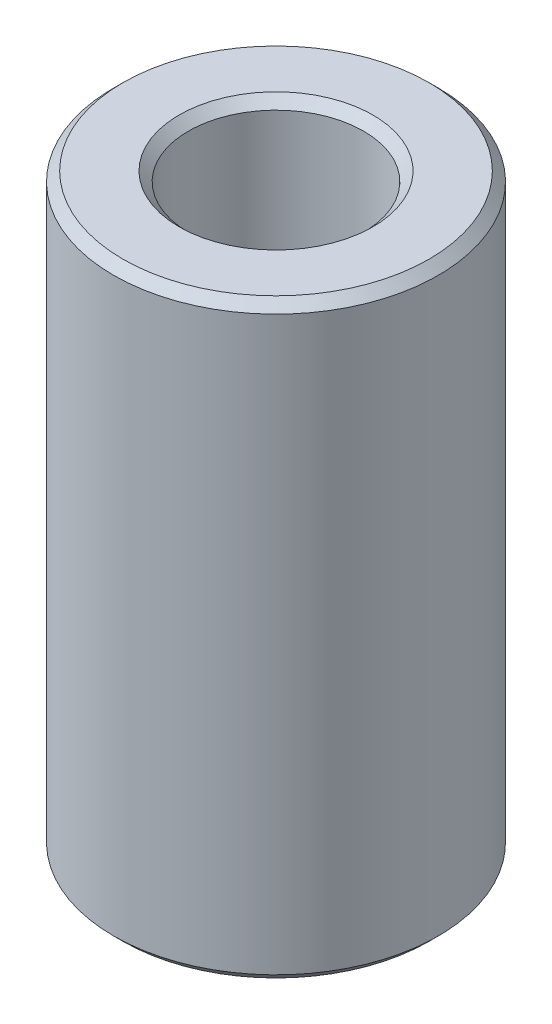
ISO-10303-21;
HEADER;
FILE_DESCRIPTION(('STEP AP214'),'2;1');
FILE_NAME('part.step','',(''),(''),'','','');
FILE_SCHEMA(('AUTOMOTIVE_DESIGN { 1 0 10303 214 1 1 1 1 }'));
ENDSEC;
DATA;
#1=APPLICATION_CONTEXT('core data for automotive mechanical design processes');
#2=APPLICATION_PROTOCOL_DEFINITION('international standard','automotive_design',2000,#1);
#3=PRODUCT_CONTEXT('',#1,'mechanical');
#4=PRODUCT('Part','Part','',(#3));
#5=PRODUCT_RELATED_PRODUCT_CATEGORY('part','',(#4));
#6=PRODUCT_DEFINITION_FORMATION('','',#4);
#7=PRODUCT_DEFINITION_CONTEXT('part definition',#1,'design');
#8=PRODUCT_DEFINITION('design','',#6,#7);
#9=PRODUCT_DEFINITION_SHAPE('','',#8);
#10=(LENGTH_UNIT() NAMED_UNIT(*) SI_UNIT(.MILLI.,.METRE.));
#11=(NAMED_UNIT(*) PLANE_ANGLE_UNIT() SI_UNIT($,.RADIAN.));
#12=(NAMED_UNIT(*) SI_UNIT($,.STERADIAN.) SOLID_ANGLE_UNIT());
#13=UNCERTAINTY_MEASURE_WITH_UNIT(LENGTH_MEASURE(1.E-05),#10,'distance_accuracy_value','');
#14=(GEOMETRIC_REPRESENTATION_CONTEXT(3) GLOBAL_UNCERTAINTY_ASSIGNED_CONTEXT((#13)) GLOBAL_UNIT_ASSIGNED_CONTEXT((#10,
#11,#12)) REPRESENTATION_CONTEXT('',''));
#15=CARTESIAN_POINT('',(0.,0.,0.));
#16=DIRECTION('',(0.,0.,1.));
#17=DIRECTION('',(1.,0.,0.));
#18=AXIS2_PLACEMENT_3D('',#15,#16,#17);
#19=CARTESIAN_POINT('',(0.,54.6031220626706,0.));
#20=DIRECTION('',(0.,-1.,0.));
#21=DIRECTION('',(0.,0.,-1.));
#22=AXIS2_PLACEMENT_3D('',#19,#20,#21);
#23=CYLINDRICAL_SURFACE('',#22,15.);
#24=CARTESIAN_POINT('',(0.,0.860244968208142,0.));
#25=DIRECTION('',(0.,1.,0.));
#26=DIRECTION('',(0.,0.,1.));
#27=AXIS2_PLACEMENT_3D('',#24,#25,#26);
#28=CIRCLE('',#27,15.);
#29=CARTESIAN_POINT('',(0.,0.860244968208142,-15.));
#30=VERTEX_POINT('',#29);
#31=EDGE_CURVE('E10',#30,#30,#28,.T.);
#32=CARTESIAN_POINT('',(0.,53.7428770944626,0.));
#33=DIRECTION('',(0.,1.,0.));
#34=DIRECTION('',(0.,0.,1.));
#35=AXIS2_PLACEMENT_3D('',#32,#33,#34);
#36=CIRCLE('',#35,15.);
#37=CARTESIAN_POINT('',(0.,53.7428770944626,-15.));
#38=VERTEX_POINT('',#37);
#39=EDGE_CURVE('E50',#38,#38,#36,.F.);
#40=CARTESIAN_POINT('',(0.,0.860244968208142,-15.));
#41=CARTESIAN_POINT('',(0.,1.41110571952329,-15.));
#42=CARTESIAN_POINT('',(0.,1.96196647083844,-15.));
#43=CARTESIAN_POINT('',(0.,3.06368797346874,-15.));
#44=CARTESIAN_POINT('',(0.,3.61454872478389,-15.));
#45=CARTESIAN_POINT('',(0.,4.71627022741419,-15.));
#46=CARTESIAN_POINT('',(0.,5.26713097872934,-15.));
#47=CARTESIAN_POINT('',(0.,6.36885248135964,-15.));
#48=CARTESIAN_POINT('',(0.,6.91971323267479,-15.));
#49=CARTESIAN_POINT('',(0.,8.0214347353051,-15.));
#50=CARTESIAN_POINT('',(0.,8.57229548662024,-15.));
#51=CARTESIAN_POINT('',(0.,9.67401698925054,-15.));
#52=CARTESIAN_POINT('',(0.,10.2248777405657,-15.));
#53=CARTESIAN_POINT('',(0.,11.326599243196,-15.));
#54=CARTESIAN_POINT('',(0.,11.8774599945111,-15.));
#55=CARTESIAN_POINT('',(0.,12.9791814971414,-15.));
#56=CARTESIAN_POINT('',(0.,13.5300422484566,-15.));
#57=CARTESIAN_POINT('',(0.,14.6317637510869,-15.));
#58=CARTESIAN_POINT('',(0.,15.182624502402,-15.));
#59=CARTESIAN_POINT('',(0.,16.2843460050323,-15.));
#60=CARTESIAN_POINT('',(0.,16.8352067563475,-15.));
#61=CARTESIAN_POINT('',(0.,17.9369282589778,-15.));
#62=CARTESIAN_POINT('',(0.,18.4877890102929,-15.));
#63=CARTESIAN_POINT('',(0.,19.5895105129233,-15.));
#64=CARTESIAN_POINT('',(0.,20.1403712642384,-15.));
#65=CARTESIAN_POINT('',(0.,21.2420927668687,-15.));
#66=CARTESIAN_POINT('',(0.,21.7929535181839,-15.));
#67=CARTESIAN_POINT('',(0.,22.8946750208142,-15.));
#68=CARTESIAN_POINT('',(0.,23.4455357721293,-15.));
#69=CARTESIAN_POINT('',(0.,24.5472572747596,-15.));
#70=CARTESIAN_POINT('',(0.,25.0981180260748,-15.));
#71=CARTESIAN_POINT('',(0.,26.1998395287051,-15.));
#72=CARTESIAN_POINT('',(0.,26.7507002800202,-15.));
#73=CARTESIAN_POINT('',(0.,27.8524217826505,-15.));
#74=CARTESIAN_POINT('',(0.,28.4032825339657,-15.));
#75=CARTESIAN_POINT('',(0.,29.505004036596,-15.));
#76=CARTESIAN_POINT('',(0.,30.0558647879111,-15.));
#77=CARTESIAN_POINT('',(0.,31.1575862905414,-15.));
#78=CARTESIAN_POINT('',(0.,31.7084470418566,-15.));
#79=CARTESIAN_POINT('',(0.,32.8101685444869,-15.));
#80=CARTESIAN_POINT('',(0.,33.361029295802,-15.));
#81=CARTESIAN_POINT('',(0.,34.4627507984323,-15.));
#82=CARTESIAN_POINT('',(0.,35.0136115497475,-15.));
#83=CARTESIAN_POINT('',(0.,36.1153330523778,-15.));
#84=CARTESIAN_POINT('',(0.,36.6661938036929,-15.));
#85=CARTESIAN_POINT('',(0.,37.7679153063232,-15.));
#86=CARTESIAN_POINT('',(0.,38.3187760576384,-15.));
#87=CARTESIAN_POINT('',(0.,39.4204975602687,-15.));
#88=CARTESIAN_POINT('',(0.,39.9713583115838,-15.));
#89=CARTESIAN_POINT('',(0.,41.0730798142141,-15.));
#90=CARTESIAN_POINT('',(0.,41.6239405655293,-15.));
#91=CARTESIAN_POINT('',(0.,42.7256620681596,-15.));
#92=CARTESIAN_POINT('',(0.,43.2765228194747,-15.));
#93=CARTESIAN_POINT('',(0.,44.378244322105,-15.));
#94=CARTESIAN_POINT('',(0.,44.9291050734202,-15.));
#95=CARTESIAN_POINT('',(0.,46.0308265760505,-15.));
#96=CARTESIAN_POINT('',(0.,46.5816873273656,-15.));
#97=CARTESIAN_POINT('',(0.,47.6834088299959,-15.));
#98=CARTESIAN_POINT('',(0.,48.2342695813111,-15.));
#99=CARTESIAN_POINT('',(0.,49.3359910839414,-15.));
#100=CARTESIAN_POINT('',(0.,49.8868518352565,-15.));
#101=CARTESIAN_POINT('',(0.,50.9885733378868,-15.));
#102=CARTESIAN_POINT('',(0.,51.539434089202,-15.));
#103=CARTESIAN_POINT('',(0.,52.6411555918323,-15.));
#104=CARTESIAN_POINT('',(0.,53.1920163431474,-15.));
#105=CARTESIAN_POINT('',(0.,53.7428770944626,-15.));
#106=B_SPLINE_CURVE_WITH_KNOTS('',3,(#40,#41,#42,#43,#44,#45,#46,#47,#48,#49,#50,#51,#52,#53,
#54,#55,#56,#57,#58,#59,#60,#61,#62,#63,#64,#65,#66,#67,#68,#69,#70,#71,#72,#73,#74,#75,#76,#77,
#78,#79,#80,#81,#82,#83,#84,#85,#86,#87,#88,#89,#90,#91,#92,#93,#94,#95,#96,#97,#98,#99,#100,
#101,#102,#103,#104,#105),.UNSPECIFIED.,.F.,.F.,(4,2,2,2,2,2,2,2,2,2,2,2,2,2,2,2,2,2,2,2,2,2,2,
2,2,2,2,2,2,2,2,2,4),(0.,1.65258225394545,3.3051645078909,4.95774676183635,6.6103290157818,
8.26291126972725,9.91549352367271,11.5680757776182,13.2206580315636,14.8732402855091,
16.5258225394545,18.1784047934,19.8309870473454,21.4835693012909,23.1361515552363,
24.7887338091818,26.4413160631272,28.0938983170727,29.7464805710181,31.3990628249636,
33.051645078909,34.7042273328545,36.3568095867999,38.0093918407454,39.6619740946908,
41.3145563486363,42.9671386025817,44.6197208565272,46.2723031104726,47.9248853644181,
49.5774676183635,51.230049872309,52.8826321262544),.UNSPECIFIED.);
#107=EDGE_CURVE('BSEAM39',#30,#38,#106,.T.);
#108=ORIENTED_EDGE('',*,*,#31,.T.);
#109=ORIENTED_EDGE('',*,*,#39,.T.);
#110=ORIENTED_EDGE('',*,*,#107,.T.);
#111=ORIENTED_EDGE('',*,*,#107,.F.);
#112=EDGE_LOOP('',(#108,#110,#109,#111));
#113=FACE_BOUND('',#112,.T.);
#114=ADVANCED_FACE('F39',(#113),#23,.T.);
#115=CARTESIAN_POINT('',(0.,54.6031220626706,0.));
#116=DIRECTION('',(0.,1.,0.));
#117=DIRECTION('',(0.,0.,1.));
#118=AXIS2_PLACEMENT_3D('',#115,#116,#117);
#119=PLANE('',#118);
#120=CARTESIAN_POINT('',(0.,54.6031220626706,0.));
#121=DIRECTION('',(0.,1.,0.));
#122=DIRECTION('',(0.,0.,1.));
#123=AXIS2_PLACEMENT_3D('',#120,#121,#122);
#124=CIRCLE('',#123,8.95730590564783);
#125=CARTESIAN_POINT('',(0.,54.6031220626706,8.95730590564783));
#126=VERTEX_POINT('',#125);
#127=EDGE_CURVE('E58',#126,#126,#124,.F.);
#128=ORIENTED_EDGE('',*,*,#127,.T.);
#129=EDGE_LOOP('',(#128));
#130=FACE_BOUND('',#129,.T.);
#131=CARTESIAN_POINT('',(0.,54.6031220626706,0.));
#132=DIRECTION('',(0.,1.,0.));
#133=DIRECTION('',(0.,0.,1.));
#134=AXIS2_PLACEMENT_3D('',#131,#132,#133);
#135=CIRCLE('',#134,14.1397550317919);
#136=CARTESIAN_POINT('',(0.,54.6031220626706,-14.1397550317919));
#137=VERTEX_POINT('',#136);
#138=EDGE_CURVE('E61',#137,#137,#135,.T.);
#139=ORIENTED_EDGE('',*,*,#138,.T.);
#140=EDGE_LOOP('',(#139));
#141=FACE_BOUND('',#140,.T.);
#142=ADVANCED_FACE('F88',(#130,#141),#119,.T.);
#143=CARTESIAN_POINT('',(0.,0.,0.));
#144=DIRECTION('',(0.,1.,0.));
#145=DIRECTION('',(0.,0.,1.));
#146=AXIS2_PLACEMENT_3D('',#143,#144,#145);
#147=PLANE('',#146);
#148=CARTESIAN_POINT('',(0.,0.,0.));
#149=DIRECTION('',(0.,1.,0.));
#150=DIRECTION('',(0.,0.,1.));
#151=AXIS2_PLACEMENT_3D('',#148,#149,#150);
#152=CIRCLE('',#151,8.95730590564778);
#153=CARTESIAN_POINT('',(0.,0.,8.95730590564778));
#154=VERTEX_POINT('',#153);
#155=EDGE_CURVE('E51',#154,#154,#152,.T.);
#156=ORIENTED_EDGE('',*,*,#155,.T.);
#157=EDGE_LOOP('',(#156));
#158=FACE_BOUND('',#157,.T.);
#159=CARTESIAN_POINT('',(0.,0.,0.));
#160=DIRECTION('',(0.,1.,0.));
#161=DIRECTION('',(0.,0.,1.));
#162=AXIS2_PLACEMENT_3D('',#159,#160,#161);
#163=CIRCLE('',#162,14.1397550317918);
#164=CARTESIAN_POINT('',(0.,0.,14.1397550317918));
#165=VERTEX_POINT('',#164);
#166=EDGE_CURVE('E54',#165,#165,#163,.F.);
#167=ORIENTED_EDGE('',*,*,#166,.T.);
#168=EDGE_LOOP('',(#167));
#169=FACE_BOUND('',#168,.T.);
#170=ADVANCED_FACE('F83',(#158,#169),#147,.F.);
#171=CARTESIAN_POINT('',(0.,54.6031220626706,0.));
#172=DIRECTION('',(0.,-1.,0.));
#173=DIRECTION('',(0.,0.,-1.));
#174=AXIS2_PLACEMENT_3D('',#171,#172,#173);
#175=CYLINDRICAL_SURFACE('',#174,8.0970609374397);
#176=CARTESIAN_POINT('',(0.,53.7428770944625,0.));
#177=DIRECTION('',(0.,1.,0.));
#178=DIRECTION('',(0.,0.,1.));
#179=AXIS2_PLACEMENT_3D('',#176,#177,#178);
#180=CIRCLE('',#179,8.0970609374397);
#181=CARTESIAN_POINT('',(0.,53.7428770944625,-8.0970609374397));
#182=VERTEX_POINT('',#181);
#183=EDGE_CURVE('E67',#182,#182,#180,.T.);
#184=CARTESIAN_POINT('',(0.,0.860244968208093,0.));
#185=DIRECTION('',(0.,1.,0.));
#186=DIRECTION('',(0.,0.,1.));
#187=AXIS2_PLACEMENT_3D('',#184,#185,#186);
#188=CIRCLE('',#187,8.0970609374397);
#189=CARTESIAN_POINT('',(0.,0.860244968208086,-8.0970609374397));
#190=VERTEX_POINT('',#189);
#191=EDGE_CURVE('E69',#190,#190,#188,.F.);
#192=CARTESIAN_POINT('',(0.,53.7428770944625,-8.0970609374397));
#193=CARTESIAN_POINT('',(0.,53.1920163431474,-8.0970609374397));
#194=CARTESIAN_POINT('',(0.,52.6411555918322,-8.0970609374397));
#195=CARTESIAN_POINT('',(0.,51.5394340892019,-8.0970609374397));
#196=CARTESIAN_POINT('',(0.,50.9885733378868,-8.0970609374397));
#197=CARTESIAN_POINT('',(0.,49.8868518352565,-8.0970609374397));
#198=CARTESIAN_POINT('',(0.,49.3359910839413,-8.0970609374397));
#199=CARTESIAN_POINT('',(0.,48.234269581311,-8.0970609374397));
#200=CARTESIAN_POINT('',(0.,47.6834088299959,-8.0970609374397));
#201=CARTESIAN_POINT('',(0.,46.5816873273656,-8.0970609374397));
#202=CARTESIAN_POINT('',(0.,46.0308265760504,-8.0970609374397));
#203=CARTESIAN_POINT('',(0.,44.9291050734201,-8.0970609374397));
#204=CARTESIAN_POINT('',(0.,44.378244322105,-8.0970609374397));
#205=CARTESIAN_POINT('',(0.,43.2765228194747,-8.0970609374397));
#206=CARTESIAN_POINT('',(0.,42.7256620681595,-8.0970609374397));
#207=CARTESIAN_POINT('',(0.,41.6239405655292,-8.0970609374397));
#208=CARTESIAN_POINT('',(0.,41.0730798142141,-8.0970609374397));
#209=CARTESIAN_POINT('',(0.,39.9713583115838,-8.0970609374397));
#210=CARTESIAN_POINT('',(0.,39.4204975602686,-8.0970609374397));
#211=CARTESIAN_POINT('',(0.,38.3187760576383,-8.0970609374397));
#212=CARTESIAN_POINT('',(0.,37.7679153063232,-8.0970609374397));
#213=CARTESIAN_POINT('',(0.,36.6661938036929,-8.0970609374397));
#214=CARTESIAN_POINT('',(0.,36.1153330523777,-8.0970609374397));
#215=CARTESIAN_POINT('',(0.,35.0136115497474,-8.0970609374397));
#216=CARTESIAN_POINT('',(0.,34.4627507984323,-8.0970609374397));
#217=CARTESIAN_POINT('',(0.,33.361029295802,-8.0970609374397));
#218=CARTESIAN_POINT('',(0.,32.8101685444868,-8.0970609374397));
#219=CARTESIAN_POINT('',(0.,31.7084470418565,-8.0970609374397));
#220=CARTESIAN_POINT('',(0.,31.1575862905414,-8.0970609374397));
#221=CARTESIAN_POINT('',(0.,30.0558647879111,-8.0970609374397));
#222=CARTESIAN_POINT('',(0.,29.5050040365959,-8.0970609374397));
#223=CARTESIAN_POINT('',(0.,28.4032825339656,-8.0970609374397));
#224=CARTESIAN_POINT('',(0.,27.8524217826505,-8.0970609374397));
#225=CARTESIAN_POINT('',(0.,26.7507002800202,-8.0970609374397));
#226=CARTESIAN_POINT('',(0.,26.199839528705,-8.0970609374397));
#227=CARTESIAN_POINT('',(0.,25.0981180260747,-8.0970609374397));
#228=CARTESIAN_POINT('',(0.,24.5472572747596,-8.0970609374397));
#229=CARTESIAN_POINT('',(0.,23.4455357721293,-8.0970609374397));
#230=CARTESIAN_POINT('',(0.,22.8946750208141,-8.0970609374397));
#231=CARTESIAN_POINT('',(0.,21.7929535181838,-8.0970609374397));
#232=CARTESIAN_POINT('',(0.,21.2420927668686,-8.0970609374397));
#233=CARTESIAN_POINT('',(0.,20.1403712642384,-8.0970609374397));
#234=CARTESIAN_POINT('',(0.,19.5895105129232,-8.0970609374397));
#235=CARTESIAN_POINT('',(0.,18.4877890102929,-8.0970609374397));
#236=CARTESIAN_POINT('',(0.,17.9369282589778,-8.0970609374397));
#237=CARTESIAN_POINT('',(0.,16.8352067563475,-8.0970609374397));
#238=CARTESIAN_POINT('',(0.,16.2843460050323,-8.0970609374397));
#239=CARTESIAN_POINT('',(0.,15.182624502402,-8.0970609374397));
#240=CARTESIAN_POINT('',(0.,14.6317637510868,-8.0970609374397));
#241=CARTESIAN_POINT('',(0.,13.5300422484565,-8.0970609374397));
#242=CARTESIAN_POINT('',(0.,12.9791814971414,-8.0970609374397));
#243=CARTESIAN_POINT('',(0.,11.8774599945111,-8.0970609374397));
#244=CARTESIAN_POINT('',(0.,11.3265992431959,-8.0970609374397));
#245=CARTESIAN_POINT('',(0.,10.2248777405656,-8.0970609374397));
#246=CARTESIAN_POINT('',(0.,9.67401698925049,-8.0970609374397));
#247=CARTESIAN_POINT('',(0.,8.57229548662019,-8.0970609374397));
#248=CARTESIAN_POINT('',(0.,8.02143473530504,-8.0970609374397));
#249=CARTESIAN_POINT('',(0.,6.91971323267474,-8.0970609374397));
#250=CARTESIAN_POINT('',(0.,6.36885248135959,-8.0970609374397));
#251=CARTESIAN_POINT('',(0.,5.26713097872929,-8.0970609374397));
#252=CARTESIAN_POINT('',(0.,4.71627022741415,-8.0970609374397));
#253=CARTESIAN_POINT('',(0.,3.61454872478384,-8.0970609374397));
#254=CARTESIAN_POINT('',(0.,3.06368797346869,-8.0970609374397));
#255=CARTESIAN_POINT('',(0.,1.96196647083838,-8.0970609374397));
#256=CARTESIAN_POINT('',(0.,1.41110571952324,-8.0970609374397));
#257=CARTESIAN_POINT('',(0.,0.860244968208086,-8.0970609374397));
#258=B_SPLINE_CURVE_WITH_KNOTS('',3,(#192,#193,#194,#195,#196,#197,#198,#199,#200,#201,#202,
#203,#204,#205,#206,#207,#208,#209,#210,#211,#212,#213,#214,#215,#216,#217,#218,#219,#220,#221,
#222,#223,#224,#225,#226,#227,#228,#229,#230,#231,#232,#233,#234,#235,#236,#237,#238,#239,#240,
#241,#242,#243,#244,#245,#246,#247,#248,#249,#250,#251,#252,#253,#254,#255,#256,#257),
.UNSPECIFIED.,.F.,.F.,(4,2,2,2,2,2,2,2,2,2,2,2,2,2,2,2,2,2,2,2,2,2,2,2,2,2,2,2,2,2,2,2,4),(0.,
1.65258225394545,3.3051645078909,4.95774676183636,6.6103290157818,8.26291126972726,
9.91549352367271,11.5680757776182,13.2206580315636,14.8732402855091,16.5258225394545,
18.1784047934,19.8309870473454,21.4835693012909,23.1361515552363,24.7887338091818,
26.4413160631272,28.0938983170727,29.7464805710181,31.3990628249636,33.051645078909,
34.7042273328545,36.3568095867999,38.0093918407454,39.6619740946908,41.3145563486363,
42.9671386025817,44.6197208565272,46.2723031104726,47.9248853644181,49.5774676183635,
51.230049872309,52.8826321262544),.UNSPECIFIED.);
#259=EDGE_CURVE('BSEAM71',#182,#190,#258,.T.);
#260=ORIENTED_EDGE('',*,*,#183,.T.);
#261=ORIENTED_EDGE('',*,*,#191,.T.);
#262=ORIENTED_EDGE('',*,*,#259,.T.);
#263=ORIENTED_EDGE('',*,*,#259,.F.);
#264=EDGE_LOOP('',(#260,#262,#261,#263));
#265=FACE_BOUND('',#264,.T.);
#266=ADVANCED_FACE('F71',(#265),#175,.F.);
#267=CARTESIAN_POINT('',(0.,53.7428770944625,0.));
#268=DIRECTION('',(0.,1.,0.));
#269=DIRECTION('',(0.,0.,1.));
#270=AXIS2_PLACEMENT_3D('',#267,#268,#269);
#271=CONICAL_SURFACE('',#270,8.0970609374397,0.785398163397448);
#272=ORIENTED_EDGE('',*,*,#127,.F.);
#273=EDGE_LOOP('',(#272));
#274=FACE_BOUND('',#273,.T.);
#275=ORIENTED_EDGE('',*,*,#183,.F.);
#276=EDGE_LOOP('',(#275));
#277=FACE_BOUND('',#276,.T.);
#278=ADVANCED_FACE('F77',(#274,#277),#271,.F.);
#279=CARTESIAN_POINT('',(0.,0.,0.));
#280=DIRECTION('',(0.,-1.,0.));
#281=DIRECTION('',(0.,0.,-1.));
#282=AXIS2_PLACEMENT_3D('',#279,#280,#281);
#283=CONICAL_SURFACE('',#282,8.95730590564778,0.78539816339744);
#284=ORIENTED_EDGE('',*,*,#191,.F.);
#285=EDGE_LOOP('',(#284));
#286=FACE_BOUND('',#285,.T.);
#287=ORIENTED_EDGE('',*,*,#155,.F.);
#288=EDGE_LOOP('',(#287));
#289=FACE_BOUND('',#288,.T.);
#290=ADVANCED_FACE('F73',(#286,#289),#283,.F.);
#291=CARTESIAN_POINT('',(0.,0.860244968208142,0.));
#292=DIRECTION('',(0.,1.,0.));
#293=DIRECTION('',(0.,0.,1.));
#294=AXIS2_PLACEMENT_3D('',#291,#292,#293);
#295=CONICAL_SURFACE('',#294,15.,0.785398163397454);
#296=ORIENTED_EDGE('',*,*,#166,.F.);
#297=EDGE_LOOP('',(#296));
#298=FACE_BOUND('',#297,.T.);
#299=ORIENTED_EDGE('',*,*,#31,.F.);
#300=EDGE_LOOP('',(#299));
#301=FACE_BOUND('',#300,.T.);
#302=ADVANCED_FACE('F76',(#298,#301),#295,.T.);
#303=CARTESIAN_POINT('',(0.,54.6031220626706,0.));
#304=DIRECTION('',(0.,-1.,0.));
#305=DIRECTION('',(0.,0.,-1.));
#306=AXIS2_PLACEMENT_3D('',#303,#304,#305);
#307=CONICAL_SURFACE('',#306,14.1397550317919,0.785398163397441);
#308=CARTESIAN_POINT('',(0.,53.7428770944626,-15.));
#309=CARTESIAN_POINT('',(0.,53.7518379795481,-14.9910391149145));
#310=CARTESIAN_POINT('',(0.,53.7607988646336,-14.982078229829));
#311=CARTESIAN_POINT('',(0.,53.7787206348046,-14.964156459658));
#312=CARTESIAN_POINT('',(0.,53.7876815198901,-14.9551955745725));
#313=CARTESIAN_POINT('',(0.,53.8056032900611,-14.9372738044015));
#314=CARTESIAN_POINT('',(0.,53.8145641751466,-14.928312919316));
#315=CARTESIAN_POINT('',(0.,53.8324859453176,-14.910391149145));
#316=CARTESIAN_POINT('',(0.,53.8414468304031,-14.9014302640595));
#317=CARTESIAN_POINT('',(0.,53.8593686005741,-14.8835084938885));
#318=CARTESIAN_POINT('',(0.,53.8683294856596,-14.874547608803));
#319=CARTESIAN_POINT('',(0.,53.8862512558306,-14.856625838632));
#320=CARTESIAN_POINT('',(0.,53.8952121409161,-14.8476649535465));
#321=CARTESIAN_POINT('',(0.,53.9131339110871,-14.8297431833755));
#322=CARTESIAN_POINT('',(0.,53.9220947961726,-14.82078229829));
#323=CARTESIAN_POINT('',(0.,53.9400165663436,-14.802860528119));
#324=CARTESIAN_POINT('',(0.,53.9489774514291,-14.7938996430335));
#325=CARTESIAN_POINT('',(0.,53.9668992216001,-14.7759778728625));
#326=CARTESIAN_POINT('',(0.,53.9758601066856,-14.767016987777));
#327=CARTESIAN_POINT('',(0.,53.9937818768566,-14.749095217606));
#328=CARTESIAN_POINT('',(0.,54.0027427619421,-14.7401343325205));
#329=CARTESIAN_POINT('',(0.,54.0206645321131,-14.7222125623495));
#330=CARTESIAN_POINT('',(0.,54.0296254171986,-14.713251677264));
#331=CARTESIAN_POINT('',(0.,54.0475471873696,-14.695329907093));
#332=CARTESIAN_POINT('',(0.,54.0565080724551,-14.6863690220075));
#333=CARTESIAN_POINT('',(0.,54.0744298426261,-14.6684472518365));
#334=CARTESIAN_POINT('',(0.,54.0833907277116,-14.659486366751));
#335=CARTESIAN_POINT('',(0.,54.1013124978826,-14.64156459658));
#336=CARTESIAN_POINT('',(0.,54.1102733829681,-14.6326037114945));
#337=CARTESIAN_POINT('',(0.,54.1281951531391,-14.6146819413235));
#338=CARTESIAN_POINT('',(0.,54.1371560382246,-14.605721056238));
#339=CARTESIAN_POINT('',(0.,54.1550778083956,-14.587799286067));
#340=CARTESIAN_POINT('',(0.,54.1640386934811,-14.5788384009815));
#341=CARTESIAN_POINT('',(0.,54.1819604636521,-14.5609166308105));
#342=CARTESIAN_POINT('',(0.,54.1909213487376,-14.551955745725));
#343=CARTESIAN_POINT('',(0.,54.2088431189086,-14.534033975554));
#344=CARTESIAN_POINT('',(0.,54.2178040039941,-14.5250730904685));
#345=CARTESIAN_POINT('',(0.,54.2357257741651,-14.5071513202975));
#346=CARTESIAN_POINT('',(0.,54.2446866592506,-14.498190435212));
#347=CARTESIAN_POINT('',(0.,54.2626084294216,-14.480268665041));
#348=CARTESIAN_POINT('',(0.,54.2715693145071,-14.4713077799555));
#349=CARTESIAN_POINT('',(0.,54.2894910846781,-14.4533860097845));
#350=CARTESIAN_POINT('',(0.,54.2984519697636,-14.444425124699));
#351=CARTESIAN_POINT('',(0.,54.3163737399346,-14.426503354528));
#352=CARTESIAN_POINT('',(0.,54.3253346250201,-14.4175424694425));
#353=CARTESIAN_POINT('',(0.,54.3432563951911,-14.3996206992715));
#354=CARTESIAN_POINT('',(0.,54.3522172802766,-14.390659814186));
#355=CARTESIAN_POINT('',(0.,54.3701390504476,-14.372738044015));
#356=CARTESIAN_POINT('',(0.,54.3790999355331,-14.3637771589295));
#357=CARTESIAN_POINT('',(0.,54.3970217057041,-14.3458553887585));
#358=CARTESIAN_POINT('',(0.,54.4059825907896,-14.3368945036729));
#359=CARTESIAN_POINT('',(0.,54.4239043609606,-14.3189727335019));
#360=CARTESIAN_POINT('',(0.,54.4328652460461,-14.3100118484164));
#361=CARTESIAN_POINT('',(0.,54.4507870162171,-14.2920900782454));
#362=CARTESIAN_POINT('',(0.,54.4597479013026,-14.2831291931599));
#363=CARTESIAN_POINT('',(0.,54.4776696714736,-14.2652074229889));
#364=CARTESIAN_POINT('',(0.,54.4866305565591,-14.2562465379034));
#365=CARTESIAN_POINT('',(0.,54.5045523267301,-14.2383247677324));
#366=CARTESIAN_POINT('',(0.,54.5135132118156,-14.2293638826469));
#367=CARTESIAN_POINT('',(0.,54.5314349819866,-14.2114421124759));
#368=CARTESIAN_POINT('',(0.,54.5403958670721,-14.2024812273904));
#369=CARTESIAN_POINT('',(0.,54.5583176372431,-14.1845594572194));
#370=CARTESIAN_POINT('',(0.,54.5672785223286,-14.1755985721339));
#371=CARTESIAN_POINT('',(0.,54.5852002924996,-14.1576768019629));
#372=CARTESIAN_POINT('',(0.,54.5941611775851,-14.1487159168774));
#373=CARTESIAN_POINT('',(0.,54.6031220626706,-14.1397550317919));
#374=B_SPLINE_CURVE_WITH_KNOTS('',3,(#308,#309,#310,#311,#312,#313,#314,#315,#316,#317,#318,
#319,#320,#321,#322,#323,#324,#325,#326,#327,#328,#329,#330,#331,#332,#333,#334,#335,#336,#337,
#338,#339,#340,#341,#342,#343,#344,#345,#346,#347,#348,#349,#350,#351,#352,#353,#354,#355,#356,
#357,#358,#359,#360,#361,#362,#363,#364,#365,#366,#367,#368,#369,#370,#371,#372,#373),
.UNSPECIFIED.,.F.,.F.,(4,2,2,2,2,2,2,2,2,2,2,2,2,2,2,2,2,2,2,2,2,2,2,2,2,2,2,2,2,2,2,2,4),(0.,
0.0380178156563499,0.0760356313126936,0.114053446969039,0.152071262625383,0.190089078281733,
0.228106893938078,0.266124709594422,0.304142525250767,0.342160340907117,0.380178156563462,
0.418195972219805,0.45621378787615,0.4942316035325,0.532249419188845,0.57026723484519,
0.608285050501534,0.646302866157884,0.684320681814229,0.722338497470574,0.760356313126919,
0.798374128783267,0.836391944439612,0.874409760095957,0.912427575752307,0.950445391408652,
0.988463207064996,1.02648102272134,1.06449883837769,1.10251665403404,1.14053446969038,
1.17855228534672,1.21657010100307),.UNSPECIFIED.);
#375=EDGE_CURVE('BSEAM45',#38,#137,#374,.T.);
#376=ORIENTED_EDGE('',*,*,#39,.F.);
#377=ORIENTED_EDGE('',*,*,#138,.F.);
#378=ORIENTED_EDGE('',*,*,#375,.T.);
#379=ORIENTED_EDGE('',*,*,#375,.F.);
#380=EDGE_LOOP('',(#376,#378,#377,#379));
#381=FACE_BOUND('',#380,.T.);
#382=ADVANCED_FACE('F45',(#381),#307,.T.);
#383=CLOSED_SHELL('',(#114,#142,#170,#266,#278,#290,#302,#382));
#384=MANIFOLD_SOLID_BREP('B2',#383);
#385=ADVANCED_BREP_SHAPE_REPRESENTATION('',(#18,#384),#14);
#386=SHAPE_DEFINITION_REPRESENTATION(#9,#385);
ENDSEC;
END-ISO-10303-21;
